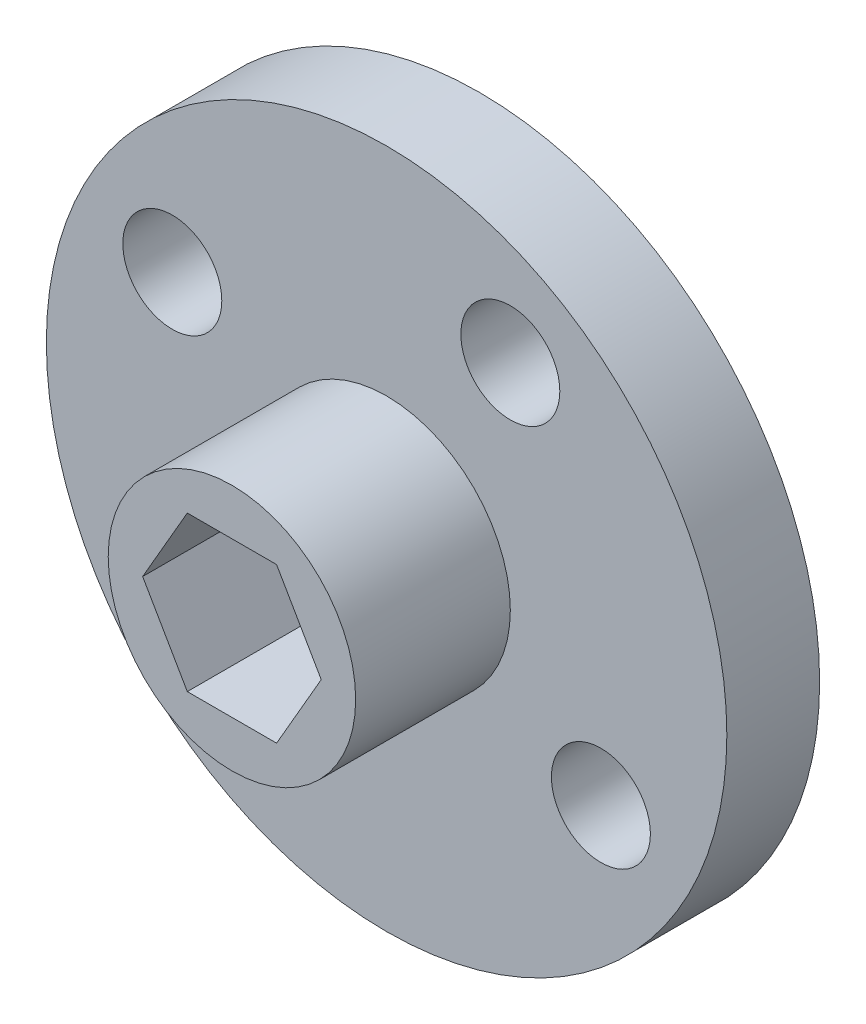
ISO-10303-21;
HEADER;
FILE_DESCRIPTION(('STEP AP214'),'2;1');
FILE_NAME('part.step','',(''),(''),'','','');
FILE_SCHEMA(('AUTOMOTIVE_DESIGN { 1 0 10303 214 1 1 1 1 }'));
ENDSEC;
DATA;
#1=APPLICATION_CONTEXT('core data for automotive mechanical design processes');
#2=APPLICATION_PROTOCOL_DEFINITION('international standard','automotive_design',2000,#1);
#3=PRODUCT_CONTEXT('',#1,'mechanical');
#4=PRODUCT('Part','Part','',(#3));
#5=PRODUCT_RELATED_PRODUCT_CATEGORY('part','',(#4));
#6=PRODUCT_DEFINITION_FORMATION('','',#4);
#7=PRODUCT_DEFINITION_CONTEXT('part definition',#1,'design');
#8=PRODUCT_DEFINITION('design','',#6,#7);
#9=PRODUCT_DEFINITION_SHAPE('','',#8);
#10=(LENGTH_UNIT() NAMED_UNIT(*) SI_UNIT(.MILLI.,.METRE.));
#11=(NAMED_UNIT(*) PLANE_ANGLE_UNIT() SI_UNIT($,.RADIAN.));
#12=(NAMED_UNIT(*) SI_UNIT($,.STERADIAN.) SOLID_ANGLE_UNIT());
#13=UNCERTAINTY_MEASURE_WITH_UNIT(LENGTH_MEASURE(1.E-05),#10,'distance_accuracy_value','');
#14=(GEOMETRIC_REPRESENTATION_CONTEXT(3) GLOBAL_UNCERTAINTY_ASSIGNED_CONTEXT((#13)) GLOBAL_UNIT_ASSIGNED_CONTEXT((#10,
#11,#12)) REPRESENTATION_CONTEXT('',''));
#15=CARTESIAN_POINT('',(0.,0.,0.));
#16=DIRECTION('',(0.,0.,1.));
#17=DIRECTION('',(1.,0.,0.));
#18=AXIS2_PLACEMENT_3D('',#15,#16,#17);
#19=CARTESIAN_POINT('',(0.,0.,8.));
#20=DIRECTION('',(0.,0.,-1.));
#21=DIRECTION('',(-1.,0.,0.));
#22=AXIS2_PLACEMENT_3D('',#19,#20,#21);
#23=CYLINDRICAL_SURFACE('',#22,4.);
#24=CARTESIAN_POINT('',(0.,0.,3.));
#25=DIRECTION('',(0.,0.,-1.));
#26=DIRECTION('',(-1.,0.,0.));
#27=AXIS2_PLACEMENT_3D('',#24,#25,#26);
#28=CIRCLE('',#27,4.);
#29=CARTESIAN_POINT('',(-4.,0.,3.));
#30=VERTEX_POINT('',#29);
#31=EDGE_CURVE('E119',#30,#30,#28,.T.);
#32=ORIENTED_EDGE('',*,*,#31,.F.);
#33=EDGE_LOOP('',(#32));
#34=FACE_BOUND('',#33,.T.);
#35=CARTESIAN_POINT('',(0.,0.,8.));
#36=DIRECTION('',(0.,0.,-1.));
#37=DIRECTION('',(-1.,0.,0.));
#38=AXIS2_PLACEMENT_3D('',#35,#36,#37);
#39=CIRCLE('',#38,4.);
#40=CARTESIAN_POINT('',(-4.,0.,8.));
#41=VERTEX_POINT('',#40);
#42=EDGE_CURVE('E20',#41,#41,#39,.F.);
#43=ORIENTED_EDGE('',*,*,#42,.F.);
#44=EDGE_LOOP('',(#43));
#45=FACE_BOUND('',#44,.T.);
#46=ADVANCED_FACE('F17',(#34,#45),#23,.T.);
#47=CARTESIAN_POINT('',(0.,0.,8.));
#48=DIRECTION('',(0.,0.,1.));
#49=DIRECTION('',(1.,0.,0.));
#50=AXIS2_PLACEMENT_3D('',#47,#48,#49);
#51=PLANE('',#50);
#52=ORIENTED_EDGE('',*,*,#42,.T.);
#53=EDGE_LOOP('',(#52));
#54=FACE_BOUND('',#53,.T.);
#55=DIRECTION('',(-0.5,0.866025403784439,0.));
#56=VECTOR('',#55,1.);
#57=CARTESIAN_POINT('',(2.88675134594813,0.,8.));
#58=LINE('',#57,#56);
#59=CARTESIAN_POINT('',(1.44337567297407,2.5,8.));
#60=VERTEX_POINT('',#59);
#61=CARTESIAN_POINT('',(2.88675134594813,0.,8.));
#62=VERTEX_POINT('',#61);
#63=EDGE_CURVE('E306',#60,#62,#58,.F.);
#64=ORIENTED_EDGE('',*,*,#63,.T.);
#65=DIRECTION('',(0.5,0.866025403784439,0.));
#66=VECTOR('',#65,1.);
#67=CARTESIAN_POINT('',(1.44337567297406,-2.5,8.));
#68=LINE('',#67,#66);
#69=CARTESIAN_POINT('',(1.44337567297406,-2.5,8.));
#70=VERTEX_POINT('',#69);
#71=EDGE_CURVE('E326',#62,#70,#68,.F.);
#72=ORIENTED_EDGE('',*,*,#71,.T.);
#73=DIRECTION('',(1.,0.,0.));
#74=VECTOR('',#73,1.);
#75=CARTESIAN_POINT('',(-1.44337567297407,-2.5,8.));
#76=LINE('',#75,#74);
#77=CARTESIAN_POINT('',(-1.44337567297407,-2.5,8.));
#78=VERTEX_POINT('',#77);
#79=EDGE_CURVE('E321',#70,#78,#76,.F.);
#80=ORIENTED_EDGE('',*,*,#79,.T.);
#81=DIRECTION('',(0.5,-0.866025403784439,0.));
#82=VECTOR('',#81,1.);
#83=CARTESIAN_POINT('',(-2.88675134594813,0.,8.));
#84=LINE('',#83,#82);
#85=CARTESIAN_POINT('',(-2.88675134594813,0.,8.));
#86=VERTEX_POINT('',#85);
#87=EDGE_CURVE('E73',#78,#86,#84,.F.);
#88=ORIENTED_EDGE('',*,*,#87,.T.);
#89=DIRECTION('',(-0.5,-0.866025403784439,0.));
#90=VECTOR('',#89,1.);
#91=CARTESIAN_POINT('',(-1.44337567297406,2.5,8.));
#92=LINE('',#91,#90);
#93=CARTESIAN_POINT('',(-1.44337567297406,2.5,8.));
#94=VERTEX_POINT('',#93);
#95=EDGE_CURVE('E71',#86,#94,#92,.F.);
#96=ORIENTED_EDGE('',*,*,#95,.T.);
#97=DIRECTION('',(1.,0.,0.));
#98=VECTOR('',#97,1.);
#99=CARTESIAN_POINT('',(1.44337567297407,2.5,8.));
#100=LINE('',#99,#98);
#101=EDGE_CURVE('E68',#94,#60,#100,.T.);
#102=ORIENTED_EDGE('',*,*,#101,.T.);
#103=EDGE_LOOP('',(#64,#72,#80,#88,#96,#102));
#104=FACE_BOUND('',#103,.T.);
#105=ADVANCED_FACE('F72',(#54,#104),#51,.T.);
#106=CARTESIAN_POINT('',(0.,0.,3.));
#107=DIRECTION('',(0.,0.,1.));
#108=DIRECTION('',(1.,0.,0.));
#109=AXIS2_PLACEMENT_3D('',#106,#107,#108);
#110=PLANE('',#109);
#111=CARTESIAN_POINT('',(0.,0.,3.));
#112=DIRECTION('',(0.,0.,-1.));
#113=DIRECTION('',(-1.,0.,0.));
#114=AXIS2_PLACEMENT_3D('',#111,#112,#113);
#115=CIRCLE('',#114,11.);
#116=CARTESIAN_POINT('',(-11.,0.,3.));
#117=VERTEX_POINT('',#116);
#118=EDGE_CURVE('E106',#117,#117,#115,.T.);
#119=ORIENTED_EDGE('',*,*,#118,.F.);
#120=EDGE_LOOP('',(#119));
#121=FACE_BOUND('',#120,.T.);
#122=ORIENTED_EDGE('',*,*,#31,.T.);
#123=EDGE_LOOP('',(#122));
#124=FACE_BOUND('',#123,.T.);
#125=CARTESIAN_POINT('',(-6.92820323027551,4.,3.));
#126=DIRECTION('',(0.,0.,1.));
#127=DIRECTION('',(1.,0.,0.));
#128=AXIS2_PLACEMENT_3D('',#125,#126,#127);
#129=CIRCLE('',#128,1.6);
#130=CARTESIAN_POINT('',(-5.32820323027551,4.,3.));
#131=VERTEX_POINT('',#130);
#132=EDGE_CURVE('E79',#131,#131,#129,.F.);
#133=ORIENTED_EDGE('',*,*,#132,.T.);
#134=EDGE_LOOP('',(#133));
#135=FACE_BOUND('',#134,.T.);
#136=CARTESIAN_POINT('',(4.00000000000002,6.92820323027549,3.));
#137=DIRECTION('',(0.,0.,1.));
#138=DIRECTION('',(1.,0.,0.));
#139=AXIS2_PLACEMENT_3D('',#136,#137,#138);
#140=CIRCLE('',#139,1.6);
#141=CARTESIAN_POINT('',(5.60000000000003,6.92820323027549,3.));
#142=VERTEX_POINT('',#141);
#143=EDGE_CURVE('E111',#142,#142,#140,.F.);
#144=ORIENTED_EDGE('',*,*,#143,.T.);
#145=EDGE_LOOP('',(#144));
#146=FACE_BOUND('',#145,.T.);
#147=CARTESIAN_POINT('',(6.92820323027551,-4.,3.));
#148=DIRECTION('',(0.,0.,1.));
#149=DIRECTION('',(1.,0.,0.));
#150=AXIS2_PLACEMENT_3D('',#147,#148,#149);
#151=CIRCLE('',#150,1.6);
#152=CARTESIAN_POINT('',(8.52820323027551,-4.,3.));
#153=VERTEX_POINT('',#152);
#154=EDGE_CURVE('E114',#153,#153,#151,.F.);
#155=ORIENTED_EDGE('',*,*,#154,.T.);
#156=EDGE_LOOP('',(#155));
#157=FACE_BOUND('',#156,.T.);
#158=CARTESIAN_POINT('',(-4.00000000000007,-6.92820323027547,3.));
#159=DIRECTION('',(0.,0.,1.));
#160=DIRECTION('',(1.,0.,0.));
#161=AXIS2_PLACEMENT_3D('',#158,#159,#160);
#162=CIRCLE('',#161,1.6);
#163=CARTESIAN_POINT('',(-2.40000000000007,-6.92820323027547,3.));
#164=VERTEX_POINT('',#163);
#165=EDGE_CURVE('E117',#164,#164,#162,.F.);
#166=ORIENTED_EDGE('',*,*,#165,.T.);
#167=EDGE_LOOP('',(#166));
#168=FACE_BOUND('',#167,.T.);
#169=ADVANCED_FACE('F132',(#121,#124,#135,#146,#157,#168),#110,.T.);
#170=CARTESIAN_POINT('',(-4.00000000000007,-6.92820323027547,0.));
#171=DIRECTION('',(0.,0.,1.));
#172=DIRECTION('',(1.,0.,0.));
#173=AXIS2_PLACEMENT_3D('',#170,#171,#172);
#174=CYLINDRICAL_SURFACE('',#173,1.6);
#175=CARTESIAN_POINT('',(-4.00000000000007,-6.92820323027547,0.));
#176=DIRECTION('',(0.,0.,1.));
#177=DIRECTION('',(1.,0.,0.));
#178=AXIS2_PLACEMENT_3D('',#175,#176,#177);
#179=CIRCLE('',#178,1.6);
#180=CARTESIAN_POINT('',(-2.40000000000007,-6.92820323027547,0.));
#181=VERTEX_POINT('',#180);
#182=EDGE_CURVE('E103',#181,#181,#179,.F.);
#183=ORIENTED_EDGE('',*,*,#182,.T.);
#184=EDGE_LOOP('',(#183));
#185=FACE_BOUND('',#184,.T.);
#186=ORIENTED_EDGE('',*,*,#165,.F.);
#187=EDGE_LOOP('',(#186));
#188=FACE_BOUND('',#187,.T.);
#189=ADVANCED_FACE('F176',(#185,#188),#174,.F.);
#190=CARTESIAN_POINT('',(6.92820323027551,-4.,0.));
#191=DIRECTION('',(0.,0.,1.));
#192=DIRECTION('',(1.,0.,0.));
#193=AXIS2_PLACEMENT_3D('',#190,#191,#192);
#194=CYLINDRICAL_SURFACE('',#193,1.6);
#195=CARTESIAN_POINT('',(6.92820323027551,-4.,0.));
#196=DIRECTION('',(0.,0.,1.));
#197=DIRECTION('',(1.,0.,0.));
#198=AXIS2_PLACEMENT_3D('',#195,#196,#197);
#199=CIRCLE('',#198,1.6);
#200=CARTESIAN_POINT('',(8.52820323027551,-4.,0.));
#201=VERTEX_POINT('',#200);
#202=EDGE_CURVE('E100',#201,#201,#199,.F.);
#203=ORIENTED_EDGE('',*,*,#202,.T.);
#204=EDGE_LOOP('',(#203));
#205=FACE_BOUND('',#204,.T.);
#206=ORIENTED_EDGE('',*,*,#154,.F.);
#207=EDGE_LOOP('',(#206));
#208=FACE_BOUND('',#207,.T.);
#209=ADVANCED_FACE('F172',(#205,#208),#194,.F.);
#210=CARTESIAN_POINT('',(4.00000000000002,6.92820323027549,0.));
#211=DIRECTION('',(0.,0.,1.));
#212=DIRECTION('',(1.,0.,0.));
#213=AXIS2_PLACEMENT_3D('',#210,#211,#212);
#214=CYLINDRICAL_SURFACE('',#213,1.6);
#215=CARTESIAN_POINT('',(4.00000000000002,6.92820323027549,0.));
#216=DIRECTION('',(0.,0.,1.));
#217=DIRECTION('',(1.,0.,0.));
#218=AXIS2_PLACEMENT_3D('',#215,#216,#217);
#219=CIRCLE('',#218,1.6);
#220=CARTESIAN_POINT('',(5.60000000000003,6.92820323027549,0.));
#221=VERTEX_POINT('',#220);
#222=EDGE_CURVE('E97',#221,#221,#219,.F.);
#223=ORIENTED_EDGE('',*,*,#222,.T.);
#224=EDGE_LOOP('',(#223));
#225=FACE_BOUND('',#224,.T.);
#226=ORIENTED_EDGE('',*,*,#143,.F.);
#227=EDGE_LOOP('',(#226));
#228=FACE_BOUND('',#227,.T.);
#229=ADVANCED_FACE('F168',(#225,#228),#214,.F.);
#230=CARTESIAN_POINT('',(-6.92820323027551,4.,0.));
#231=DIRECTION('',(0.,0.,1.));
#232=DIRECTION('',(1.,0.,0.));
#233=AXIS2_PLACEMENT_3D('',#230,#231,#232);
#234=CYLINDRICAL_SURFACE('',#233,1.6);
#235=CARTESIAN_POINT('',(-6.92820323027551,4.,0.));
#236=DIRECTION('',(0.,0.,1.));
#237=DIRECTION('',(1.,0.,0.));
#238=AXIS2_PLACEMENT_3D('',#235,#236,#237);
#239=CIRCLE('',#238,1.6);
#240=CARTESIAN_POINT('',(-5.32820323027551,4.,0.));
#241=VERTEX_POINT('',#240);
#242=EDGE_CURVE('E94',#241,#241,#239,.F.);
#243=ORIENTED_EDGE('',*,*,#242,.T.);
#244=EDGE_LOOP('',(#243));
#245=FACE_BOUND('',#244,.T.);
#246=ORIENTED_EDGE('',*,*,#132,.F.);
#247=EDGE_LOOP('',(#246));
#248=FACE_BOUND('',#247,.T.);
#249=ADVANCED_FACE('F165',(#245,#248),#234,.F.);
#250=CARTESIAN_POINT('',(-1.44337567297406,2.5,0.));
#251=DIRECTION('',(-0.866025403784439,0.5,0.));
#252=DIRECTION('',(-0.5,-0.866025403784439,0.));
#253=AXIS2_PLACEMENT_3D('',#250,#251,#252);
#254=PLANE('',#253);
#255=DIRECTION('',(0.,0.,1.));
#256=VECTOR('',#255,1.);
#257=CARTESIAN_POINT('',(-2.88675134594813,0.,0.));
#258=LINE('',#257,#256);
#259=CARTESIAN_POINT('',(-2.88675134594813,0.,0.));
#260=VERTEX_POINT('',#259);
#261=EDGE_CURVE('E319',#86,#260,#258,.F.);
#262=ORIENTED_EDGE('',*,*,#261,.T.);
#263=DIRECTION('',(0.5,0.866025403784438,0.));
#264=VECTOR('',#263,1.);
#265=CARTESIAN_POINT('',(-2.88675134594813,0.,0.));
#266=LINE('',#265,#264);
#267=CARTESIAN_POINT('',(-1.44337567297406,2.5,0.));
#268=VERTEX_POINT('',#267);
#269=EDGE_CURVE('E90',#260,#268,#266,.T.);
#270=ORIENTED_EDGE('',*,*,#269,.T.);
#271=DIRECTION('',(0.,0.,1.));
#272=VECTOR('',#271,1.);
#273=CARTESIAN_POINT('',(-1.44337567297406,2.5,0.));
#274=LINE('',#273,#272);
#275=EDGE_CURVE('E78',#268,#94,#274,.T.);
#276=ORIENTED_EDGE('',*,*,#275,.T.);
#277=ORIENTED_EDGE('',*,*,#95,.F.);
#278=EDGE_LOOP('',(#262,#270,#276,#277));
#279=FACE_BOUND('',#278,.T.);
#280=ADVANCED_FACE('F89',(#279),#254,.F.);
#281=CARTESIAN_POINT('',(1.44337567297407,2.5,0.));
#282=DIRECTION('',(0.,1.,0.));
#283=DIRECTION('',(0.,0.,1.));
#284=AXIS2_PLACEMENT_3D('',#281,#282,#283);
#285=PLANE('',#284);
#286=ORIENTED_EDGE('',*,*,#275,.F.);
#287=DIRECTION('',(1.,0.,0.));
#288=VECTOR('',#287,1.);
#289=CARTESIAN_POINT('',(0.,2.5,0.));
#290=LINE('',#289,#288);
#291=CARTESIAN_POINT('',(1.44337567297407,2.5,0.));
#292=VERTEX_POINT('',#291);
#293=EDGE_CURVE('E309',#268,#292,#290,.T.);
#294=ORIENTED_EDGE('',*,*,#293,.T.);
#295=DIRECTION('',(0.,0.,1.));
#296=VECTOR('',#295,1.);
#297=CARTESIAN_POINT('',(1.44337567297407,2.5,0.));
#298=LINE('',#297,#296);
#299=EDGE_CURVE('E86',#292,#60,#298,.T.);
#300=ORIENTED_EDGE('',*,*,#299,.T.);
#301=ORIENTED_EDGE('',*,*,#101,.F.);
#302=EDGE_LOOP('',(#286,#294,#300,#301));
#303=FACE_BOUND('',#302,.T.);
#304=ADVANCED_FACE('F83',(#303),#285,.F.);
#305=CARTESIAN_POINT('',(2.88675134594813,0.,0.));
#306=DIRECTION('',(0.866025403784439,0.5,0.));
#307=DIRECTION('',(-0.5,0.866025403784439,0.));
#308=AXIS2_PLACEMENT_3D('',#305,#306,#307);
#309=PLANE('',#308);
#310=ORIENTED_EDGE('',*,*,#299,.F.);
#311=DIRECTION('',(0.5,-0.866025403784439,0.));
#312=VECTOR('',#311,1.);
#313=CARTESIAN_POINT('',(1.44337567297407,2.5,0.));
#314=LINE('',#313,#312);
#315=CARTESIAN_POINT('',(2.88675134594813,0.,0.));
#316=VERTEX_POINT('',#315);
#317=EDGE_CURVE('E305',#292,#316,#314,.T.);
#318=ORIENTED_EDGE('',*,*,#317,.T.);
#319=DIRECTION('',(0.,0.,1.));
#320=VECTOR('',#319,1.);
#321=CARTESIAN_POINT('',(2.88675134594813,0.,0.));
#322=LINE('',#321,#320);
#323=EDGE_CURVE('E328',#316,#62,#322,.T.);
#324=ORIENTED_EDGE('',*,*,#323,.T.);
#325=ORIENTED_EDGE('',*,*,#63,.F.);
#326=EDGE_LOOP('',(#310,#318,#324,#325));
#327=FACE_BOUND('',#326,.T.);
#328=ADVANCED_FACE('F156',(#327),#309,.F.);
#329=CARTESIAN_POINT('',(1.44337567297406,-2.5,0.));
#330=DIRECTION('',(0.866025403784439,-0.5,0.));
#331=DIRECTION('',(0.5,0.866025403784439,0.));
#332=AXIS2_PLACEMENT_3D('',#329,#330,#331);
#333=PLANE('',#332);
#334=ORIENTED_EDGE('',*,*,#323,.F.);
#335=DIRECTION('',(-0.5,-0.866025403784438,0.));
#336=VECTOR('',#335,1.);
#337=CARTESIAN_POINT('',(2.88675134594813,0.,0.));
#338=LINE('',#337,#336);
#339=CARTESIAN_POINT('',(1.44337567297406,-2.5,0.));
#340=VERTEX_POINT('',#339);
#341=EDGE_CURVE('E311',#316,#340,#338,.T.);
#342=ORIENTED_EDGE('',*,*,#341,.T.);
#343=DIRECTION('',(0.,0.,1.));
#344=VECTOR('',#343,1.);
#345=CARTESIAN_POINT('',(1.44337567297406,-2.5,0.));
#346=LINE('',#345,#344);
#347=EDGE_CURVE('E323',#340,#70,#346,.T.);
#348=ORIENTED_EDGE('',*,*,#347,.T.);
#349=ORIENTED_EDGE('',*,*,#71,.F.);
#350=EDGE_LOOP('',(#334,#342,#348,#349));
#351=FACE_BOUND('',#350,.T.);
#352=ADVANCED_FACE('F152',(#351),#333,.F.);
#353=CARTESIAN_POINT('',(-1.44337567297407,-2.5,0.));
#354=DIRECTION('',(0.,-1.,0.));
#355=DIRECTION('',(1.,0.,0.));
#356=AXIS2_PLACEMENT_3D('',#353,#354,#355);
#357=PLANE('',#356);
#358=ORIENTED_EDGE('',*,*,#347,.F.);
#359=DIRECTION('',(1.,0.,0.));
#360=VECTOR('',#359,1.);
#361=CARTESIAN_POINT('',(0.,-2.5,0.));
#362=LINE('',#361,#360);
#363=CARTESIAN_POINT('',(-1.44337567297407,-2.5,0.));
#364=VERTEX_POINT('',#363);
#365=EDGE_CURVE('E333',#340,#364,#362,.F.);
#366=ORIENTED_EDGE('',*,*,#365,.T.);
#367=DIRECTION('',(0.,0.,1.));
#368=VECTOR('',#367,1.);
#369=CARTESIAN_POINT('',(-1.44337567297407,-2.5,0.));
#370=LINE('',#369,#368);
#371=EDGE_CURVE('E35',#364,#78,#370,.T.);
#372=ORIENTED_EDGE('',*,*,#371,.T.);
#373=ORIENTED_EDGE('',*,*,#79,.F.);
#374=EDGE_LOOP('',(#358,#366,#372,#373));
#375=FACE_BOUND('',#374,.T.);
#376=ADVANCED_FACE('F149',(#375),#357,.F.);
#377=CARTESIAN_POINT('',(-2.88675134594813,0.,0.));
#378=DIRECTION('',(-0.866025403784439,-0.5,0.));
#379=DIRECTION('',(0.5,-0.866025403784439,0.));
#380=AXIS2_PLACEMENT_3D('',#377,#378,#379);
#381=PLANE('',#380);
#382=ORIENTED_EDGE('',*,*,#371,.F.);
#383=DIRECTION('',(-0.5,0.866025403784439,0.));
#384=VECTOR('',#383,1.);
#385=CARTESIAN_POINT('',(-1.44337567297407,-2.5,0.));
#386=LINE('',#385,#384);
#387=EDGE_CURVE('E26',#364,#260,#386,.T.);
#388=ORIENTED_EDGE('',*,*,#387,.T.);
#389=ORIENTED_EDGE('',*,*,#261,.F.);
#390=ORIENTED_EDGE('',*,*,#87,.F.);
#391=EDGE_LOOP('',(#382,#388,#389,#390));
#392=FACE_BOUND('',#391,.T.);
#393=ADVANCED_FACE('F141',(#392),#381,.F.);
#394=CARTESIAN_POINT('',(0.,0.,3.));
#395=DIRECTION('',(0.,0.,-1.));
#396=DIRECTION('',(-1.,0.,0.));
#397=AXIS2_PLACEMENT_3D('',#394,#395,#396);
#398=CYLINDRICAL_SURFACE('',#397,11.);
#399=ORIENTED_EDGE('',*,*,#118,.T.);
#400=EDGE_LOOP('',(#399));
#401=FACE_BOUND('',#400,.T.);
#402=CARTESIAN_POINT('',(0.,0.,0.));
#403=DIRECTION('',(0.,0.,-1.));
#404=DIRECTION('',(-1.,0.,0.));
#405=AXIS2_PLACEMENT_3D('',#402,#403,#404);
#406=CIRCLE('',#405,11.);
#407=CARTESIAN_POINT('',(-11.,0.,0.));
#408=VERTEX_POINT('',#407);
#409=EDGE_CURVE('E10',#408,#408,#406,.F.);
#410=ORIENTED_EDGE('',*,*,#409,.T.);
#411=EDGE_LOOP('',(#410));
#412=FACE_BOUND('',#411,.T.);
#413=ADVANCED_FACE('F135',(#401,#412),#398,.T.);
#414=CARTESIAN_POINT('',(0.,0.,0.));
#415=DIRECTION('',(0.,0.,1.));
#416=DIRECTION('',(1.,0.,0.));
#417=AXIS2_PLACEMENT_3D('',#414,#415,#416);
#418=PLANE('',#417);
#419=ORIENTED_EDGE('',*,*,#409,.F.);
#420=EDGE_LOOP('',(#419));
#421=FACE_BOUND('',#420,.T.);
#422=ORIENTED_EDGE('',*,*,#365,.F.);
#423=ORIENTED_EDGE('',*,*,#341,.F.);
#424=ORIENTED_EDGE('',*,*,#317,.F.);
#425=ORIENTED_EDGE('',*,*,#293,.F.);
#426=ORIENTED_EDGE('',*,*,#269,.F.);
#427=ORIENTED_EDGE('',*,*,#387,.F.);
#428=EDGE_LOOP('',(#422,#423,#424,#425,#426,#427));
#429=FACE_BOUND('',#428,.T.);
#430=ORIENTED_EDGE('',*,*,#242,.F.);
#431=EDGE_LOOP('',(#430));
#432=FACE_BOUND('',#431,.T.);
#433=ORIENTED_EDGE('',*,*,#222,.F.);
#434=EDGE_LOOP('',(#433));
#435=FACE_BOUND('',#434,.T.);
#436=ORIENTED_EDGE('',*,*,#202,.F.);
#437=EDGE_LOOP('',(#436));
#438=FACE_BOUND('',#437,.T.);
#439=ORIENTED_EDGE('',*,*,#182,.F.);
#440=EDGE_LOOP('',(#439));
#441=FACE_BOUND('',#440,.T.);
#442=ADVANCED_FACE('F133',(#421,#429,#432,#435,#438,#441),#418,.F.);
#443=CLOSED_SHELL('',(#46,#105,#169,#189,#209,#229,#249,#280,#304,#328,#352,#376,#393,#413,#442));
#444=MANIFOLD_SOLID_BREP('B1',#443);
#445=ADVANCED_BREP_SHAPE_REPRESENTATION('',(#18,#444),#14);
#446=SHAPE_DEFINITION_REPRESENTATION(#9,#445);
ENDSEC;
END-ISO-10303-21;
